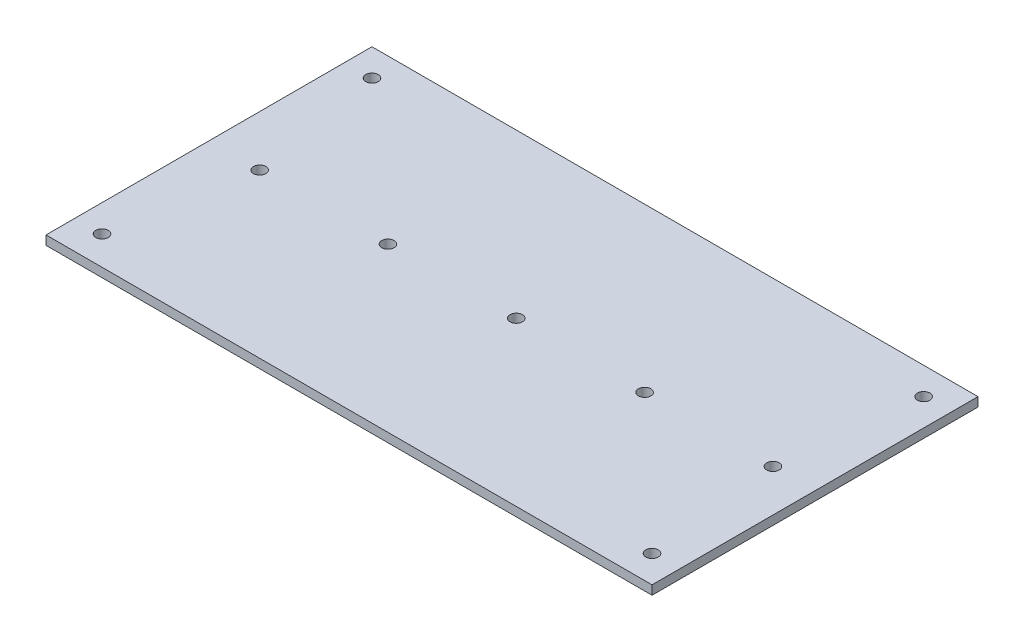
ISO-10303-21;
HEADER;
FILE_DESCRIPTION(('STEP AP214'),'2;1');
FILE_NAME('part.step','',(''),(''),'','','');
FILE_SCHEMA(('AUTOMOTIVE_DESIGN { 1 0 10303 214 1 1 1 1 }'));
ENDSEC;
DATA;
#1=APPLICATION_CONTEXT('core data for automotive mechanical design processes');
#2=APPLICATION_PROTOCOL_DEFINITION('international standard','automotive_design',2000,#1);
#3=PRODUCT_CONTEXT('',#1,'mechanical');
#4=PRODUCT('Part','Part','',(#3));
#5=PRODUCT_RELATED_PRODUCT_CATEGORY('part','',(#4));
#6=PRODUCT_DEFINITION_FORMATION('','',#4);
#7=PRODUCT_DEFINITION_CONTEXT('part definition',#1,'design');
#8=PRODUCT_DEFINITION('design','',#6,#7);
#9=PRODUCT_DEFINITION_SHAPE('','',#8);
#10=(LENGTH_UNIT() NAMED_UNIT(*) SI_UNIT(.MILLI.,.METRE.));
#11=(NAMED_UNIT(*) PLANE_ANGLE_UNIT() SI_UNIT($,.RADIAN.));
#12=(NAMED_UNIT(*) SI_UNIT($,.STERADIAN.) SOLID_ANGLE_UNIT());
#13=UNCERTAINTY_MEASURE_WITH_UNIT(LENGTH_MEASURE(1.E-05),#10,'distance_accuracy_value','');
#14=(GEOMETRIC_REPRESENTATION_CONTEXT(3) GLOBAL_UNCERTAINTY_ASSIGNED_CONTEXT((#13)) GLOBAL_UNIT_ASSIGNED_CONTEXT((#10,
#11,#12)) REPRESENTATION_CONTEXT('',''));
#15=CARTESIAN_POINT('',(0.,0.,0.));
#16=DIRECTION('',(0.,0.,1.));
#17=DIRECTION('',(1.,0.,0.));
#18=AXIS2_PLACEMENT_3D('',#15,#16,#17);
#19=CARTESIAN_POINT('',(0.,-6.35,0.));
#20=DIRECTION('',(-1.,0.,0.));
#21=DIRECTION('',(0.,0.,1.));
#22=AXIS2_PLACEMENT_3D('',#19,#20,#21);
#23=PLANE('',#22);
#24=DIRECTION('',(0.,0.,1.));
#25=VECTOR('',#24,1.);
#26=CARTESIAN_POINT('',(0.,0.,0.));
#27=LINE('',#26,#25);
#28=CARTESIAN_POINT('',(0.,0.,0.));
#29=VERTEX_POINT('',#28);
#30=CARTESIAN_POINT('',(0.,0.,228.6));
#31=VERTEX_POINT('',#30);
#32=EDGE_CURVE('E104',#29,#31,#27,.T.);
#33=ORIENTED_EDGE('',*,*,#32,.F.);
#34=DIRECTION('',(0.,1.,0.));
#35=VECTOR('',#34,1.);
#36=CARTESIAN_POINT('',(0.,-6.35,0.));
#37=LINE('',#36,#35);
#38=CARTESIAN_POINT('',(0.,-6.35,0.));
#39=VERTEX_POINT('',#38);
#40=EDGE_CURVE('E12',#39,#29,#37,.T.);
#41=ORIENTED_EDGE('',*,*,#40,.F.);
#42=DIRECTION('',(0.,0.,1.));
#43=VECTOR('',#42,1.);
#44=CARTESIAN_POINT('',(0.,-6.35,0.));
#45=LINE('',#44,#43);
#46=CARTESIAN_POINT('',(0.,-6.35,228.6));
#47=VERTEX_POINT('',#46);
#48=EDGE_CURVE('E97',#39,#47,#45,.T.);
#49=ORIENTED_EDGE('',*,*,#48,.T.);
#50=DIRECTION('',(0.,1.,0.));
#51=VECTOR('',#50,1.);
#52=CARTESIAN_POINT('',(0.,-6.35,228.6));
#53=LINE('',#52,#51);
#54=EDGE_CURVE('E42',#47,#31,#53,.T.);
#55=ORIENTED_EDGE('',*,*,#54,.T.);
#56=EDGE_LOOP('',(#33,#41,#49,#55));
#57=FACE_BOUND('',#56,.T.);
#58=ADVANCED_FACE('F39',(#57),#23,.T.);
#59=CARTESIAN_POINT('',(0.,-6.35,0.));
#60=DIRECTION('',(0.,0.,-1.));
#61=DIRECTION('',(-1.,0.,0.));
#62=AXIS2_PLACEMENT_3D('',#59,#60,#61);
#63=PLANE('',#62);
#64=DIRECTION('',(-1.,0.,0.));
#65=VECTOR('',#64,1.);
#66=CARTESIAN_POINT('',(0.,0.,0.));
#67=LINE('',#66,#65);
#68=CARTESIAN_POINT('',(425.,0.,0.));
#69=VERTEX_POINT('',#68);
#70=EDGE_CURVE('E99',#69,#29,#67,.T.);
#71=ORIENTED_EDGE('',*,*,#70,.F.);
#72=DIRECTION('',(0.,1.,0.));
#73=VECTOR('',#72,1.);
#74=CARTESIAN_POINT('',(425.,-6.35,0.));
#75=LINE('',#74,#73);
#76=CARTESIAN_POINT('',(425.,-6.35,0.));
#77=VERTEX_POINT('',#76);
#78=EDGE_CURVE('E48',#77,#69,#75,.T.);
#79=ORIENTED_EDGE('',*,*,#78,.F.);
#80=DIRECTION('',(-1.,0.,0.));
#81=VECTOR('',#80,1.);
#82=CARTESIAN_POINT('',(0.,-6.35,0.));
#83=LINE('',#82,#81);
#84=EDGE_CURVE('E94',#77,#39,#83,.T.);
#85=ORIENTED_EDGE('',*,*,#84,.T.);
#86=ORIENTED_EDGE('',*,*,#40,.T.);
#87=EDGE_LOOP('',(#71,#79,#85,#86));
#88=FACE_BOUND('',#87,.T.);
#89=ADVANCED_FACE('F126',(#88),#63,.T.);
#90=CARTESIAN_POINT('',(425.,-6.35,0.));
#91=DIRECTION('',(1.,0.,0.));
#92=DIRECTION('',(0.,0.,-1.));
#93=AXIS2_PLACEMENT_3D('',#90,#91,#92);
#94=PLANE('',#93);
#95=DIRECTION('',(0.,0.,-1.));
#96=VECTOR('',#95,1.);
#97=CARTESIAN_POINT('',(425.,0.,0.));
#98=LINE('',#97,#96);
#99=CARTESIAN_POINT('',(425.,0.,228.6));
#100=VERTEX_POINT('',#99);
#101=EDGE_CURVE('E89',#100,#69,#98,.T.);
#102=ORIENTED_EDGE('',*,*,#101,.F.);
#103=DIRECTION('',(0.,1.,0.));
#104=VECTOR('',#103,1.);
#105=CARTESIAN_POINT('',(425.,-6.35,228.6));
#106=LINE('',#105,#104);
#107=CARTESIAN_POINT('',(425.,-6.35,228.6));
#108=VERTEX_POINT('',#107);
#109=EDGE_CURVE('E84',#108,#100,#106,.T.);
#110=ORIENTED_EDGE('',*,*,#109,.F.);
#111=DIRECTION('',(0.,0.,-1.));
#112=VECTOR('',#111,1.);
#113=CARTESIAN_POINT('',(425.,-6.35,0.));
#114=LINE('',#113,#112);
#115=EDGE_CURVE('E87',#108,#77,#114,.T.);
#116=ORIENTED_EDGE('',*,*,#115,.T.);
#117=ORIENTED_EDGE('',*,*,#78,.T.);
#118=EDGE_LOOP('',(#102,#110,#116,#117));
#119=FACE_BOUND('',#118,.T.);
#120=ADVANCED_FACE('F86',(#119),#94,.T.);
#121=CARTESIAN_POINT('',(0.,-6.35,228.6));
#122=DIRECTION('',(0.,0.,1.));
#123=DIRECTION('',(1.,0.,0.));
#124=AXIS2_PLACEMENT_3D('',#121,#122,#123);
#125=PLANE('',#124);
#126=DIRECTION('',(1.,0.,0.));
#127=VECTOR('',#126,1.);
#128=CARTESIAN_POINT('',(0.,0.,228.6));
#129=LINE('',#128,#127);
#130=EDGE_CURVE('E109',#31,#100,#129,.T.);
#131=ORIENTED_EDGE('',*,*,#130,.F.);
#132=ORIENTED_EDGE('',*,*,#54,.F.);
#133=DIRECTION('',(1.,0.,0.));
#134=VECTOR('',#133,1.);
#135=CARTESIAN_POINT('',(0.,-6.35,228.6));
#136=LINE('',#135,#134);
#137=EDGE_CURVE('E93',#47,#108,#136,.T.);
#138=ORIENTED_EDGE('',*,*,#137,.T.);
#139=ORIENTED_EDGE('',*,*,#109,.T.);
#140=EDGE_LOOP('',(#131,#132,#138,#139));
#141=FACE_BOUND('',#140,.T.);
#142=ADVANCED_FACE('F96',(#141),#125,.T.);
#143=CARTESIAN_POINT('',(0.,-6.35,0.));
#144=DIRECTION('',(0.,1.,0.));
#145=DIRECTION('',(0.,0.,1.));
#146=AXIS2_PLACEMENT_3D('',#143,#144,#145);
#147=PLANE('',#146);
#148=CARTESIAN_POINT('',(19.05,-6.34999999999999,19.05));
#149=DIRECTION('',(0.,1.,0.));
#150=DIRECTION('',(0.,0.,1.));
#151=AXIS2_PLACEMENT_3D('',#148,#149,#150);
#152=CIRCLE('',#151,4.36879999999999);
#153=CARTESIAN_POINT('',(19.05,-6.34999999999999,23.4188));
#154=VERTEX_POINT('',#153);
#155=EDGE_CURVE('E187',#154,#154,#152,.T.);
#156=ORIENTED_EDGE('',*,*,#155,.T.);
#157=EDGE_LOOP('',(#156));
#158=FACE_BOUND('',#157,.T.);
#159=CARTESIAN_POINT('',(19.0340781797218,-6.34999999999999,208.365498455734));
#160=DIRECTION('',(0.,1.,0.));
#161=DIRECTION('',(0.,0.,1.));
#162=AXIS2_PLACEMENT_3D('',#159,#160,#161);
#163=CIRCLE('',#162,4.36879999999999);
#164=CARTESIAN_POINT('',(19.0340781797218,-6.34999999999999,212.734298455734));
#165=VERTEX_POINT('',#164);
#166=EDGE_CURVE('E206',#165,#165,#163,.T.);
#167=ORIENTED_EDGE('',*,*,#166,.T.);
#168=EDGE_LOOP('',(#167));
#169=FACE_BOUND('',#168,.T.);
#170=CARTESIAN_POINT('',(405.95,-6.34999999999999,19.05));
#171=DIRECTION('',(0.,1.,0.));
#172=DIRECTION('',(0.,0.,1.));
#173=AXIS2_PLACEMENT_3D('',#170,#171,#172);
#174=CIRCLE('',#173,4.36880000000001);
#175=CARTESIAN_POINT('',(405.95,-6.34999999999999,23.4188));
#176=VERTEX_POINT('',#175);
#177=EDGE_CURVE('E213',#176,#176,#174,.T.);
#178=ORIENTED_EDGE('',*,*,#177,.T.);
#179=EDGE_LOOP('',(#178));
#180=FACE_BOUND('',#179,.T.);
#181=CARTESIAN_POINT('',(405.95,-6.34999999999999,209.55));
#182=DIRECTION('',(0.,1.,0.));
#183=DIRECTION('',(0.,0.,1.));
#184=AXIS2_PLACEMENT_3D('',#181,#182,#183);
#185=CIRCLE('',#184,4.36880000000001);
#186=CARTESIAN_POINT('',(405.95,-6.34999999999999,213.9188));
#187=VERTEX_POINT('',#186);
#188=EDGE_CURVE('E221',#187,#187,#185,.T.);
#189=ORIENTED_EDGE('',*,*,#188,.T.);
#190=EDGE_LOOP('',(#189));
#191=FACE_BOUND('',#190,.T.);
#192=CARTESIAN_POINT('',(35.5,-6.35,114.3));
#193=DIRECTION('',(0.,1.,0.));
#194=DIRECTION('',(0.,0.,1.));
#195=AXIS2_PLACEMENT_3D('',#192,#193,#194);
#196=CIRCLE('',#195,4.3688);
#197=CARTESIAN_POINT('',(35.5,-6.35,118.6688));
#198=VERTEX_POINT('',#197);
#199=EDGE_CURVE('E232',#198,#198,#196,.T.);
#200=ORIENTED_EDGE('',*,*,#199,.T.);
#201=EDGE_LOOP('',(#200));
#202=FACE_BOUND('',#201,.T.);
#203=CARTESIAN_POINT('',(125.49982,-6.35,114.3));
#204=DIRECTION('',(0.,1.,0.));
#205=DIRECTION('',(0.,0.,1.));
#206=AXIS2_PLACEMENT_3D('',#203,#204,#205);
#207=CIRCLE('',#206,4.36880000000001);
#208=CARTESIAN_POINT('',(125.49982,-6.35,118.6688));
#209=VERTEX_POINT('',#208);
#210=EDGE_CURVE('E239',#209,#209,#207,.T.);
#211=ORIENTED_EDGE('',*,*,#210,.T.);
#212=EDGE_LOOP('',(#211));
#213=FACE_BOUND('',#212,.T.);
#214=CARTESIAN_POINT('',(215.49964,-6.35,114.3));
#215=DIRECTION('',(0.,1.,0.));
#216=DIRECTION('',(0.,0.,1.));
#217=AXIS2_PLACEMENT_3D('',#214,#215,#216);
#218=CIRCLE('',#217,4.36880000000001);
#219=CARTESIAN_POINT('',(215.49964,-6.35,118.6688));
#220=VERTEX_POINT('',#219);
#221=EDGE_CURVE('E247',#220,#220,#218,.T.);
#222=ORIENTED_EDGE('',*,*,#221,.T.);
#223=EDGE_LOOP('',(#222));
#224=FACE_BOUND('',#223,.T.);
#225=CARTESIAN_POINT('',(305.49946,-6.35,114.3));
#226=DIRECTION('',(0.,1.,0.));
#227=DIRECTION('',(0.,0.,1.));
#228=AXIS2_PLACEMENT_3D('',#225,#226,#227);
#229=CIRCLE('',#228,4.36880000000001);
#230=CARTESIAN_POINT('',(305.49946,-6.35,118.6688));
#231=VERTEX_POINT('',#230);
#232=EDGE_CURVE('E254',#231,#231,#229,.T.);
#233=ORIENTED_EDGE('',*,*,#232,.T.);
#234=EDGE_LOOP('',(#233));
#235=FACE_BOUND('',#234,.T.);
#236=CARTESIAN_POINT('',(395.49928,-6.35,114.3));
#237=DIRECTION('',(0.,1.,0.));
#238=DIRECTION('',(0.,0.,1.));
#239=AXIS2_PLACEMENT_3D('',#236,#237,#238);
#240=CIRCLE('',#239,4.36880000000001);
#241=CARTESIAN_POINT('',(395.49928,-6.35,118.6688));
#242=VERTEX_POINT('',#241);
#243=EDGE_CURVE('E110',#242,#242,#240,.T.);
#244=ORIENTED_EDGE('',*,*,#243,.T.);
#245=EDGE_LOOP('',(#244));
#246=FACE_BOUND('',#245,.T.);
#247=ORIENTED_EDGE('',*,*,#48,.F.);
#248=ORIENTED_EDGE('',*,*,#84,.F.);
#249=ORIENTED_EDGE('',*,*,#115,.F.);
#250=ORIENTED_EDGE('',*,*,#137,.F.);
#251=EDGE_LOOP('',(#247,#248,#249,#250));
#252=FACE_BOUND('',#251,.T.);
#253=ADVANCED_FACE('F92',(#158,#169,#180,#191,#202,#213,#224,#235,#246,#252),#147,.F.);
#254=CARTESIAN_POINT('',(0.,0.,0.));
#255=DIRECTION('',(0.,1.,0.));
#256=DIRECTION('',(0.,0.,1.));
#257=AXIS2_PLACEMENT_3D('',#254,#255,#256);
#258=PLANE('',#257);
#259=CARTESIAN_POINT('',(19.05,0.,19.05));
#260=DIRECTION('',(0.,1.,0.));
#261=DIRECTION('',(0.,0.,1.));
#262=AXIS2_PLACEMENT_3D('',#259,#260,#261);
#263=CIRCLE('',#262,4.36879999999999);
#264=CARTESIAN_POINT('',(19.05,0.,23.4188));
#265=VERTEX_POINT('',#264);
#266=EDGE_CURVE('E190',#265,#265,#263,.T.);
#267=ORIENTED_EDGE('',*,*,#266,.F.);
#268=EDGE_LOOP('',(#267));
#269=FACE_BOUND('',#268,.T.);
#270=CARTESIAN_POINT('',(19.0340781797218,0.,208.365498455734));
#271=DIRECTION('',(0.,1.,0.));
#272=DIRECTION('',(0.,0.,1.));
#273=AXIS2_PLACEMENT_3D('',#270,#271,#272);
#274=CIRCLE('',#273,4.36879999999999);
#275=CARTESIAN_POINT('',(19.0340781797218,0.,212.734298455734));
#276=VERTEX_POINT('',#275);
#277=EDGE_CURVE('E194',#276,#276,#274,.T.);
#278=ORIENTED_EDGE('',*,*,#277,.F.);
#279=EDGE_LOOP('',(#278));
#280=FACE_BOUND('',#279,.T.);
#281=CARTESIAN_POINT('',(405.95,0.,19.05));
#282=DIRECTION('',(0.,1.,0.));
#283=DIRECTION('',(0.,0.,1.));
#284=AXIS2_PLACEMENT_3D('',#281,#282,#283);
#285=CIRCLE('',#284,4.36880000000001);
#286=CARTESIAN_POINT('',(405.95,0.,23.4188));
#287=VERTEX_POINT('',#286);
#288=EDGE_CURVE('E208',#287,#287,#285,.T.);
#289=ORIENTED_EDGE('',*,*,#288,.F.);
#290=EDGE_LOOP('',(#289));
#291=FACE_BOUND('',#290,.T.);
#292=CARTESIAN_POINT('',(405.95,0.,209.55));
#293=DIRECTION('',(0.,1.,0.));
#294=DIRECTION('',(0.,0.,1.));
#295=AXIS2_PLACEMENT_3D('',#292,#293,#294);
#296=CIRCLE('',#295,4.36880000000001);
#297=CARTESIAN_POINT('',(405.95,0.,213.9188));
#298=VERTEX_POINT('',#297);
#299=EDGE_CURVE('E216',#298,#298,#296,.T.);
#300=ORIENTED_EDGE('',*,*,#299,.F.);
#301=EDGE_LOOP('',(#300));
#302=FACE_BOUND('',#301,.T.);
#303=CARTESIAN_POINT('',(35.5,0.,114.3));
#304=DIRECTION('',(0.,1.,0.));
#305=DIRECTION('',(0.,0.,1.));
#306=AXIS2_PLACEMENT_3D('',#303,#304,#305);
#307=CIRCLE('',#306,4.3688);
#308=CARTESIAN_POINT('',(35.5,0.,118.6688));
#309=VERTEX_POINT('',#308);
#310=EDGE_CURVE('E227',#309,#309,#307,.T.);
#311=ORIENTED_EDGE('',*,*,#310,.F.);
#312=EDGE_LOOP('',(#311));
#313=FACE_BOUND('',#312,.T.);
#314=CARTESIAN_POINT('',(125.49982,0.,114.3));
#315=DIRECTION('',(0.,1.,0.));
#316=DIRECTION('',(0.,0.,1.));
#317=AXIS2_PLACEMENT_3D('',#314,#315,#316);
#318=CIRCLE('',#317,4.36880000000001);
#319=CARTESIAN_POINT('',(125.49982,0.,118.6688));
#320=VERTEX_POINT('',#319);
#321=EDGE_CURVE('E234',#320,#320,#318,.T.);
#322=ORIENTED_EDGE('',*,*,#321,.F.);
#323=EDGE_LOOP('',(#322));
#324=FACE_BOUND('',#323,.T.);
#325=CARTESIAN_POINT('',(215.49964,0.,114.3));
#326=DIRECTION('',(0.,1.,0.));
#327=DIRECTION('',(0.,0.,1.));
#328=AXIS2_PLACEMENT_3D('',#325,#326,#327);
#329=CIRCLE('',#328,4.36880000000001);
#330=CARTESIAN_POINT('',(215.49964,0.,118.6688));
#331=VERTEX_POINT('',#330);
#332=EDGE_CURVE('E242',#331,#331,#329,.T.);
#333=ORIENTED_EDGE('',*,*,#332,.F.);
#334=EDGE_LOOP('',(#333));
#335=FACE_BOUND('',#334,.T.);
#336=CARTESIAN_POINT('',(305.49946,0.,114.3));
#337=DIRECTION('',(0.,1.,0.));
#338=DIRECTION('',(0.,0.,1.));
#339=AXIS2_PLACEMENT_3D('',#336,#337,#338);
#340=CIRCLE('',#339,4.36880000000001);
#341=CARTESIAN_POINT('',(305.49946,0.,118.6688));
#342=VERTEX_POINT('',#341);
#343=EDGE_CURVE('E249',#342,#342,#340,.T.);
#344=ORIENTED_EDGE('',*,*,#343,.F.);
#345=EDGE_LOOP('',(#344));
#346=FACE_BOUND('',#345,.T.);
#347=CARTESIAN_POINT('',(395.49928,0.,114.3));
#348=DIRECTION('',(0.,1.,0.));
#349=DIRECTION('',(0.,0.,1.));
#350=AXIS2_PLACEMENT_3D('',#347,#348,#349);
#351=CIRCLE('',#350,4.36880000000001);
#352=CARTESIAN_POINT('',(395.49928,0.,118.6688));
#353=VERTEX_POINT('',#352);
#354=EDGE_CURVE('E256',#353,#353,#351,.T.);
#355=ORIENTED_EDGE('',*,*,#354,.F.);
#356=EDGE_LOOP('',(#355));
#357=FACE_BOUND('',#356,.T.);
#358=ORIENTED_EDGE('',*,*,#32,.T.);
#359=ORIENTED_EDGE('',*,*,#130,.T.);
#360=ORIENTED_EDGE('',*,*,#101,.T.);
#361=ORIENTED_EDGE('',*,*,#70,.T.);
#362=EDGE_LOOP('',(#358,#359,#360,#361));
#363=FACE_BOUND('',#362,.T.);
#364=ADVANCED_FACE('F125',(#269,#280,#291,#302,#313,#324,#335,#346,#357,#363),#258,.T.);
#365=CARTESIAN_POINT('',(395.49928,0.,114.3));
#366=DIRECTION('',(0.,1.,0.));
#367=DIRECTION('',(0.,0.,1.));
#368=AXIS2_PLACEMENT_3D('',#365,#366,#367);
#369=CYLINDRICAL_SURFACE('',#368,4.36880000000001);
#370=ORIENTED_EDGE('',*,*,#243,.F.);
#371=EDGE_LOOP('',(#370));
#372=FACE_BOUND('',#371,.T.);
#373=ORIENTED_EDGE('',*,*,#354,.T.);
#374=EDGE_LOOP('',(#373));
#375=FACE_BOUND('',#374,.T.);
#376=ADVANCED_FACE('F144',(#372,#375),#369,.F.);
#377=CARTESIAN_POINT('',(305.49946,0.,114.3));
#378=DIRECTION('',(0.,1.,0.));
#379=DIRECTION('',(0.,0.,1.));
#380=AXIS2_PLACEMENT_3D('',#377,#378,#379);
#381=CYLINDRICAL_SURFACE('',#380,4.36880000000001);
#382=ORIENTED_EDGE('',*,*,#232,.F.);
#383=EDGE_LOOP('',(#382));
#384=FACE_BOUND('',#383,.T.);
#385=ORIENTED_EDGE('',*,*,#343,.T.);
#386=EDGE_LOOP('',(#385));
#387=FACE_BOUND('',#386,.T.);
#388=ADVANCED_FACE('F151',(#384,#387),#381,.F.);
#389=CARTESIAN_POINT('',(215.49964,0.,114.3));
#390=DIRECTION('',(0.,1.,0.));
#391=DIRECTION('',(0.,0.,1.));
#392=AXIS2_PLACEMENT_3D('',#389,#390,#391);
#393=CYLINDRICAL_SURFACE('',#392,4.36880000000001);
#394=ORIENTED_EDGE('',*,*,#221,.F.);
#395=EDGE_LOOP('',(#394));
#396=FACE_BOUND('',#395,.T.);
#397=ORIENTED_EDGE('',*,*,#332,.T.);
#398=EDGE_LOOP('',(#397));
#399=FACE_BOUND('',#398,.T.);
#400=ADVANCED_FACE('F155',(#396,#399),#393,.F.);
#401=CARTESIAN_POINT('',(125.49982,0.,114.3));
#402=DIRECTION('',(0.,1.,0.));
#403=DIRECTION('',(0.,0.,1.));
#404=AXIS2_PLACEMENT_3D('',#401,#402,#403);
#405=CYLINDRICAL_SURFACE('',#404,4.36880000000001);
#406=ORIENTED_EDGE('',*,*,#210,.F.);
#407=EDGE_LOOP('',(#406));
#408=FACE_BOUND('',#407,.T.);
#409=ORIENTED_EDGE('',*,*,#321,.T.);
#410=EDGE_LOOP('',(#409));
#411=FACE_BOUND('',#410,.T.);
#412=ADVANCED_FACE('F159',(#408,#411),#405,.F.);
#413=CARTESIAN_POINT('',(35.5,0.,114.3));
#414=DIRECTION('',(0.,1.,0.));
#415=DIRECTION('',(0.,0.,1.));
#416=AXIS2_PLACEMENT_3D('',#413,#414,#415);
#417=CYLINDRICAL_SURFACE('',#416,4.3688);
#418=ORIENTED_EDGE('',*,*,#199,.F.);
#419=EDGE_LOOP('',(#418));
#420=FACE_BOUND('',#419,.T.);
#421=ORIENTED_EDGE('',*,*,#310,.T.);
#422=EDGE_LOOP('',(#421));
#423=FACE_BOUND('',#422,.T.);
#424=ADVANCED_FACE('F163',(#420,#423),#417,.F.);
#425=CARTESIAN_POINT('',(405.95,0.,209.55));
#426=DIRECTION('',(0.,1.,0.));
#427=DIRECTION('',(0.,0.,1.));
#428=AXIS2_PLACEMENT_3D('',#425,#426,#427);
#429=CYLINDRICAL_SURFACE('',#428,4.36880000000001);
#430=ORIENTED_EDGE('',*,*,#188,.F.);
#431=EDGE_LOOP('',(#430));
#432=FACE_BOUND('',#431,.T.);
#433=ORIENTED_EDGE('',*,*,#299,.T.);
#434=EDGE_LOOP('',(#433));
#435=FACE_BOUND('',#434,.T.);
#436=ADVANCED_FACE('F167',(#432,#435),#429,.F.);
#437=CARTESIAN_POINT('',(405.95,0.,19.05));
#438=DIRECTION('',(0.,1.,0.));
#439=DIRECTION('',(0.,0.,1.));
#440=AXIS2_PLACEMENT_3D('',#437,#438,#439);
#441=CYLINDRICAL_SURFACE('',#440,4.36880000000001);
#442=ORIENTED_EDGE('',*,*,#177,.F.);
#443=EDGE_LOOP('',(#442));
#444=FACE_BOUND('',#443,.T.);
#445=ORIENTED_EDGE('',*,*,#288,.T.);
#446=EDGE_LOOP('',(#445));
#447=FACE_BOUND('',#446,.T.);
#448=ADVANCED_FACE('F171',(#444,#447),#441,.F.);
#449=CARTESIAN_POINT('',(19.0340781797218,0.,208.365498455734));
#450=DIRECTION('',(0.,1.,0.));
#451=DIRECTION('',(0.,0.,1.));
#452=AXIS2_PLACEMENT_3D('',#449,#450,#451);
#453=CYLINDRICAL_SURFACE('',#452,4.36879999999999);
#454=ORIENTED_EDGE('',*,*,#166,.F.);
#455=EDGE_LOOP('',(#454));
#456=FACE_BOUND('',#455,.T.);
#457=ORIENTED_EDGE('',*,*,#277,.T.);
#458=EDGE_LOOP('',(#457));
#459=FACE_BOUND('',#458,.T.);
#460=ADVANCED_FACE('F175',(#456,#459),#453,.F.);
#461=CARTESIAN_POINT('',(19.05,0.,19.05));
#462=DIRECTION('',(0.,1.,0.));
#463=DIRECTION('',(0.,0.,1.));
#464=AXIS2_PLACEMENT_3D('',#461,#462,#463);
#465=CYLINDRICAL_SURFACE('',#464,4.36879999999999);
#466=ORIENTED_EDGE('',*,*,#155,.F.);
#467=EDGE_LOOP('',(#466));
#468=FACE_BOUND('',#467,.T.);
#469=ORIENTED_EDGE('',*,*,#266,.T.);
#470=EDGE_LOOP('',(#469));
#471=FACE_BOUND('',#470,.T.);
#472=ADVANCED_FACE('F179',(#468,#471),#465,.F.);
#473=CLOSED_SHELL('',(#58,#89,#120,#142,#253,#364,#376,#388,#400,#412,#424,#436,#448,#460,#472));
#474=MANIFOLD_SOLID_BREP('B2',#473);
#475=ADVANCED_BREP_SHAPE_REPRESENTATION('',(#18,#474),#14);
#476=SHAPE_DEFINITION_REPRESENTATION(#9,#475);
ENDSEC;
END-ISO-10303-21;
